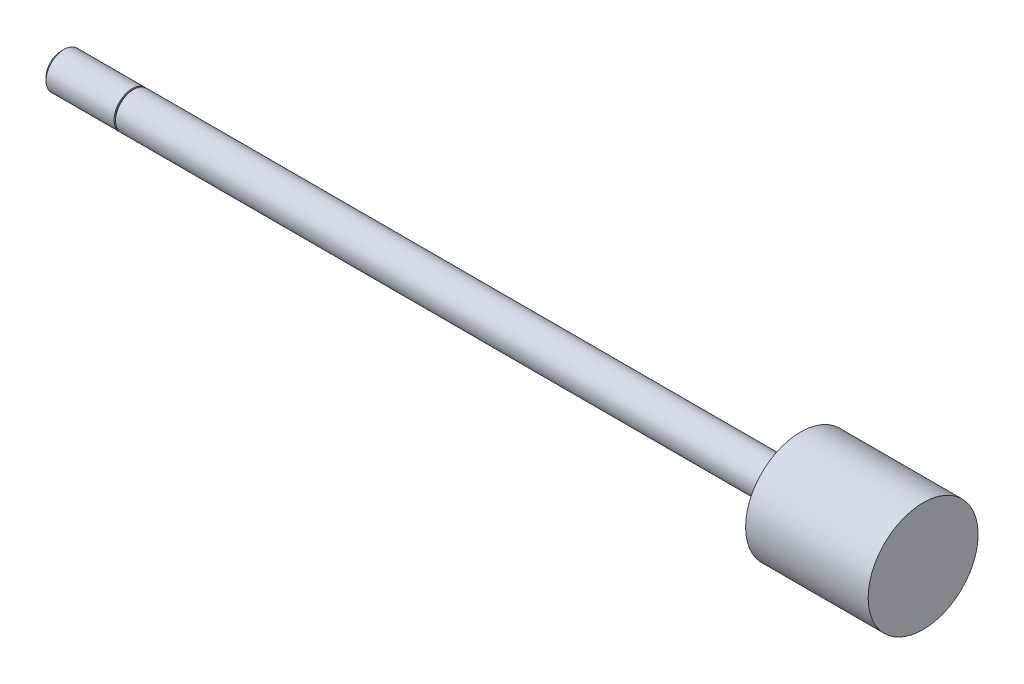
ISO-10303-21;
HEADER;
FILE_DESCRIPTION(('STEP AP214'),'2;1');
FILE_NAME('part.step','',(''),(''),'','','');
FILE_SCHEMA(('AUTOMOTIVE_DESIGN { 1 0 10303 214 1 1 1 1 }'));
ENDSEC;
DATA;
#1=APPLICATION_CONTEXT('core data for automotive mechanical design processes');
#2=APPLICATION_PROTOCOL_DEFINITION('international standard','automotive_design',2000,#1);
#3=PRODUCT_CONTEXT('',#1,'mechanical');
#4=PRODUCT('Part','Part','',(#3));
#5=PRODUCT_RELATED_PRODUCT_CATEGORY('part','',(#4));
#6=PRODUCT_DEFINITION_FORMATION('','',#4);
#7=PRODUCT_DEFINITION_CONTEXT('part definition',#1,'design');
#8=PRODUCT_DEFINITION('design','',#6,#7);
#9=PRODUCT_DEFINITION_SHAPE('','',#8);
#10=(LENGTH_UNIT() NAMED_UNIT(*) SI_UNIT(.MILLI.,.METRE.));
#11=(NAMED_UNIT(*) PLANE_ANGLE_UNIT() SI_UNIT($,.RADIAN.));
#12=(NAMED_UNIT(*) SI_UNIT($,.STERADIAN.) SOLID_ANGLE_UNIT());
#13=UNCERTAINTY_MEASURE_WITH_UNIT(LENGTH_MEASURE(1.E-05),#10,'distance_accuracy_value','');
#14=(GEOMETRIC_REPRESENTATION_CONTEXT(3) GLOBAL_UNCERTAINTY_ASSIGNED_CONTEXT((#13)) GLOBAL_UNIT_ASSIGNED_CONTEXT((#10,
#11,#12)) REPRESENTATION_CONTEXT('',''));
#15=CARTESIAN_POINT('',(0.,0.,0.));
#16=DIRECTION('',(0.,0.,1.));
#17=DIRECTION('',(1.,0.,0.));
#18=AXIS2_PLACEMENT_3D('',#15,#16,#17);
#19=CARTESIAN_POINT('',(138.1252,0.,0.));
#20=DIRECTION('',(-1.,0.,0.));
#21=DIRECTION('',(0.,0.,1.));
#22=AXIS2_PLACEMENT_3D('',#19,#20,#21);
#23=CYLINDRICAL_SURFACE('',#22,3.175);
#24=CARTESIAN_POINT('',(116.6876,0.,0.));
#25=DIRECTION('',(-1.,0.,0.));
#26=DIRECTION('',(0.,0.,1.));
#27=AXIS2_PLACEMENT_3D('',#24,#25,#26);
#28=CIRCLE('',#27,3.175);
#29=CARTESIAN_POINT('',(116.6876,0.,3.175));
#30=VERTEX_POINT('',#29);
#31=EDGE_CURVE('E10',#30,#30,#28,.T.);
#32=ORIENTED_EDGE('',*,*,#31,.T.);
#33=EDGE_LOOP('',(#32));
#34=FACE_BOUND('',#33,.T.);
#35=CARTESIAN_POINT('',(0.,0.,0.));
#36=DIRECTION('',(-1.,0.,0.));
#37=DIRECTION('',(0.,0.,1.));
#38=AXIS2_PLACEMENT_3D('',#35,#36,#37);
#39=CIRCLE('',#38,3.175);
#40=CARTESIAN_POINT('',(0.,0.,3.175));
#41=VERTEX_POINT('',#40);
#42=EDGE_CURVE('E50',#41,#41,#39,.T.);
#43=ORIENTED_EDGE('',*,*,#42,.F.);
#44=EDGE_LOOP('',(#43));
#45=FACE_BOUND('',#44,.T.);
#46=ADVANCED_FACE('F34',(#34,#45),#23,.T.);
#47=CARTESIAN_POINT('',(116.6876,3.175,0.));
#48=DIRECTION('',(1.,0.,0.));
#49=DIRECTION('',(0.,0.,-1.));
#50=AXIS2_PLACEMENT_3D('',#47,#48,#49);
#51=PLANE('',#50);
#52=ORIENTED_EDGE('',*,*,#31,.F.);
#53=EDGE_LOOP('',(#52));
#54=FACE_BOUND('',#53,.T.);
#55=CARTESIAN_POINT('',(116.6876,0.,0.));
#56=DIRECTION('',(-1.,0.,0.));
#57=DIRECTION('',(0.,0.,1.));
#58=AXIS2_PLACEMENT_3D('',#55,#56,#57);
#59=CIRCLE('',#58,9.62025);
#60=CARTESIAN_POINT('',(116.6876,0.,9.62025));
#61=VERTEX_POINT('',#60);
#62=EDGE_CURVE('E42',#61,#61,#59,.T.);
#63=ORIENTED_EDGE('',*,*,#62,.T.);
#64=EDGE_LOOP('',(#63));
#65=FACE_BOUND('',#64,.T.);
#66=ADVANCED_FACE('F84',(#54,#65),#51,.F.);
#67=CARTESIAN_POINT('',(138.1252,0.,0.));
#68=DIRECTION('',(-1.,0.,0.));
#69=DIRECTION('',(0.,0.,1.));
#70=AXIS2_PLACEMENT_3D('',#67,#68,#69);
#71=CYLINDRICAL_SURFACE('',#70,9.62025);
#72=ORIENTED_EDGE('',*,*,#62,.F.);
#73=EDGE_LOOP('',(#72));
#74=FACE_BOUND('',#73,.T.);
#75=CARTESIAN_POINT('',(138.1252,0.,0.));
#76=DIRECTION('',(-1.,0.,0.));
#77=DIRECTION('',(0.,0.,1.));
#78=AXIS2_PLACEMENT_3D('',#75,#76,#77);
#79=CIRCLE('',#78,9.62025);
#80=CARTESIAN_POINT('',(138.1252,0.,9.62025));
#81=VERTEX_POINT('',#80);
#82=EDGE_CURVE('E47',#81,#81,#79,.T.);
#83=ORIENTED_EDGE('',*,*,#82,.T.);
#84=EDGE_LOOP('',(#83));
#85=FACE_BOUND('',#84,.T.);
#86=ADVANCED_FACE('F72',(#74,#85),#71,.T.);
#87=CARTESIAN_POINT('',(138.1252,9.62025,0.));
#88=DIRECTION('',(-1.,0.,0.));
#89=DIRECTION('',(0.,0.,1.));
#90=AXIS2_PLACEMENT_3D('',#87,#88,#89);
#91=PLANE('',#90);
#92=ORIENTED_EDGE('',*,*,#82,.F.);
#93=EDGE_LOOP('',(#92));
#94=FACE_BOUND('',#93,.T.);
#95=ADVANCED_FACE('F74',(#94),#91,.F.);
#96=CARTESIAN_POINT('',(-0.254,3.429,0.));
#97=DIRECTION('',(1.,0.,0.));
#98=DIRECTION('',(0.,0.,-1.));
#99=AXIS2_PLACEMENT_3D('',#96,#97,#98);
#100=PLANE('',#99);
#101=CARTESIAN_POINT('',(-0.254,0.,0.));
#102=DIRECTION('',(-1.,0.,0.));
#103=DIRECTION('',(0.,0.,1.));
#104=AXIS2_PLACEMENT_3D('',#101,#102,#103);
#105=CIRCLE('',#104,2.921);
#106=CARTESIAN_POINT('',(-0.254,0.,2.921));
#107=VERTEX_POINT('',#106);
#108=EDGE_CURVE('E52',#107,#107,#105,.T.);
#109=ORIENTED_EDGE('',*,*,#108,.T.);
#110=EDGE_LOOP('',(#109));
#111=FACE_BOUND('',#110,.T.);
#112=CARTESIAN_POINT('',(-0.254000000000004,0.,0.));
#113=DIRECTION('',(1.,0.,0.));
#114=DIRECTION('',(0.,0.,-1.));
#115=AXIS2_PLACEMENT_3D('',#112,#113,#114);
#116=CIRCLE('',#115,3.175);
#117=CARTESIAN_POINT('',(-0.254000000000004,0.,-3.175));
#118=VERTEX_POINT('',#117);
#119=EDGE_CURVE('E38',#118,#118,#116,.T.);
#120=ORIENTED_EDGE('',*,*,#119,.T.);
#121=EDGE_LOOP('',(#120));
#122=FACE_BOUND('',#121,.T.);
#123=ADVANCED_FACE('F76',(#111,#122),#100,.T.);
#124=CARTESIAN_POINT('',(0.,2.921,0.));
#125=DIRECTION('',(-1.,0.,0.));
#126=DIRECTION('',(0.,0.,1.));
#127=AXIS2_PLACEMENT_3D('',#124,#125,#126);
#128=PLANE('',#127);
#129=CARTESIAN_POINT('',(0.,0.,0.));
#130=DIRECTION('',(-1.,0.,0.));
#131=DIRECTION('',(0.,0.,1.));
#132=AXIS2_PLACEMENT_3D('',#129,#130,#131);
#133=CIRCLE('',#132,2.921);
#134=CARTESIAN_POINT('',(0.,0.,2.921));
#135=VERTEX_POINT('',#134);
#136=EDGE_CURVE('E58',#135,#135,#133,.T.);
#137=ORIENTED_EDGE('',*,*,#136,.F.);
#138=EDGE_LOOP('',(#137));
#139=FACE_BOUND('',#138,.T.);
#140=ORIENTED_EDGE('',*,*,#42,.T.);
#141=EDGE_LOOP('',(#140));
#142=FACE_BOUND('',#141,.T.);
#143=ADVANCED_FACE('F82',(#139,#142),#128,.T.);
#144=CARTESIAN_POINT('',(0.,0.,0.));
#145=DIRECTION('',(-1.,0.,0.));
#146=DIRECTION('',(0.,0.,1.));
#147=AXIS2_PLACEMENT_3D('',#144,#145,#146);
#148=CYLINDRICAL_SURFACE('',#147,2.921);
#149=ORIENTED_EDGE('',*,*,#136,.T.);
#150=EDGE_LOOP('',(#149));
#151=FACE_BOUND('',#150,.T.);
#152=ORIENTED_EDGE('',*,*,#108,.F.);
#153=EDGE_LOOP('',(#152));
#154=FACE_BOUND('',#153,.T.);
#155=ADVANCED_FACE('F111',(#151,#154),#148,.T.);
#156=CARTESIAN_POINT('',(-12.7,0.,0.));
#157=DIRECTION('',(1.,0.,0.));
#158=DIRECTION('',(0.,0.,-1.));
#159=AXIS2_PLACEMENT_3D('',#156,#157,#158);
#160=PLANE('',#159);
#161=CARTESIAN_POINT('',(-12.7,0.,0.));
#162=DIRECTION('',(-1.,0.,0.));
#163=DIRECTION('',(0.,0.,1.));
#164=AXIS2_PLACEMENT_3D('',#161,#162,#163);
#165=CIRCLE('',#164,2.63398);
#166=CARTESIAN_POINT('',(-12.7,0.,2.63398));
#167=VERTEX_POINT('',#166);
#168=EDGE_CURVE('E67',#167,#167,#165,.T.);
#169=ORIENTED_EDGE('',*,*,#168,.T.);
#170=EDGE_LOOP('',(#169));
#171=FACE_BOUND('',#170,.T.);
#172=ADVANCED_FACE('F100',(#171),#160,.F.);
#173=CARTESIAN_POINT('',(-12.15898,0.,0.));
#174=DIRECTION('',(1.,0.,0.));
#175=DIRECTION('',(0.,0.,-1.));
#176=AXIS2_PLACEMENT_3D('',#173,#174,#175);
#177=CONICAL_SURFACE('',#176,3.175,0.785398163397448);
#178=ORIENTED_EDGE('',*,*,#168,.F.);
#179=EDGE_LOOP('',(#178));
#180=FACE_BOUND('',#179,.T.);
#181=CARTESIAN_POINT('',(-12.15898,0.,0.));
#182=DIRECTION('',(-1.,0.,0.));
#183=DIRECTION('',(0.,0.,1.));
#184=AXIS2_PLACEMENT_3D('',#181,#182,#183);
#185=CIRCLE('',#184,3.175);
#186=CARTESIAN_POINT('',(-12.15898,0.,3.175));
#187=VERTEX_POINT('',#186);
#188=EDGE_CURVE('E56',#187,#187,#185,.T.);
#189=ORIENTED_EDGE('',*,*,#188,.T.);
#190=EDGE_LOOP('',(#189));
#191=FACE_BOUND('',#190,.T.);
#192=ADVANCED_FACE('F95',(#180,#191),#177,.T.);
#193=ORIENTED_EDGE('',*,*,#188,.F.);
#194=EDGE_LOOP('',(#193));
#195=FACE_BOUND('',#194,.T.);
#196=ORIENTED_EDGE('',*,*,#119,.F.);
#197=EDGE_LOOP('',(#196));
#198=FACE_BOUND('',#197,.T.);
#199=ADVANCED_FACE('F36',(#195,#198),#23,.T.);
#200=CLOSED_SHELL('',(#46,#66,#86,#95,#123,#143,#155,#172,#192,#199));
#201=MANIFOLD_SOLID_BREP('B2',#200);
#202=ADVANCED_BREP_SHAPE_REPRESENTATION('',(#18,#201),#14);
#203=SHAPE_DEFINITION_REPRESENTATION(#9,#202);
ENDSEC;
END-ISO-10303-21;
